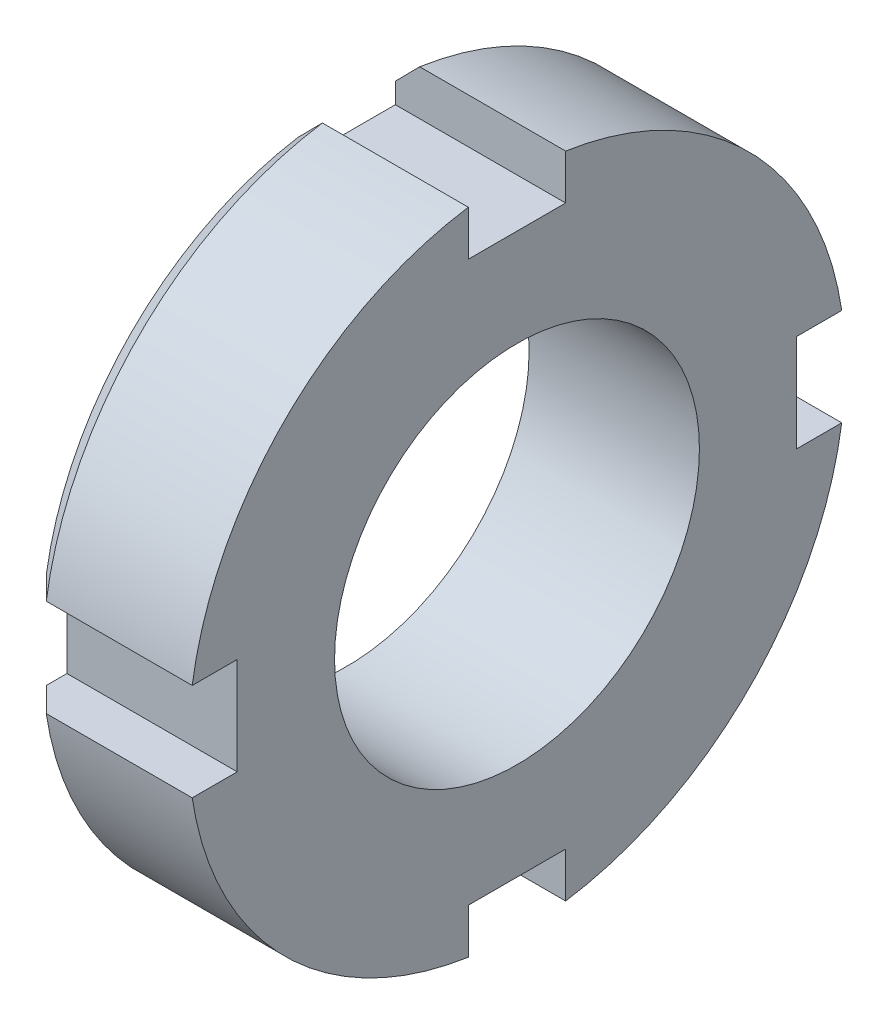
ISO-10303-21;
HEADER;
FILE_DESCRIPTION(('STEP AP214'),'2;1');
FILE_NAME('part.step','',(''),(''),'','','');
FILE_SCHEMA(('AUTOMOTIVE_DESIGN { 1 0 10303 214 1 1 1 1 }'));
ENDSEC;
DATA;
#1=APPLICATION_CONTEXT('core data for automotive mechanical design processes');
#2=APPLICATION_PROTOCOL_DEFINITION('international standard','automotive_design',2000,#1);
#3=PRODUCT_CONTEXT('',#1,'mechanical');
#4=PRODUCT('Part','Part','',(#3));
#5=PRODUCT_RELATED_PRODUCT_CATEGORY('part','',(#4));
#6=PRODUCT_DEFINITION_FORMATION('','',#4);
#7=PRODUCT_DEFINITION_CONTEXT('part definition',#1,'design');
#8=PRODUCT_DEFINITION('design','',#6,#7);
#9=PRODUCT_DEFINITION_SHAPE('','',#8);
#10=(LENGTH_UNIT() NAMED_UNIT(*) SI_UNIT(.MILLI.,.METRE.));
#11=(NAMED_UNIT(*) PLANE_ANGLE_UNIT() SI_UNIT($,.RADIAN.));
#12=(NAMED_UNIT(*) SI_UNIT($,.STERADIAN.) SOLID_ANGLE_UNIT());
#13=UNCERTAINTY_MEASURE_WITH_UNIT(LENGTH_MEASURE(1.E-05),#10,'distance_accuracy_value','');
#14=(GEOMETRIC_REPRESENTATION_CONTEXT(3) GLOBAL_UNCERTAINTY_ASSIGNED_CONTEXT((#13)) GLOBAL_UNIT_ASSIGNED_CONTEXT((#10,
#11,#12)) REPRESENTATION_CONTEXT('',''));
#15=CARTESIAN_POINT('',(0.,0.,0.));
#16=DIRECTION('',(0.,0.,1.));
#17=DIRECTION('',(1.,0.,0.));
#18=AXIS2_PLACEMENT_3D('',#15,#16,#17);
#19=CARTESIAN_POINT('',(7.,0.,0.));
#20=DIRECTION('',(-1.,0.,0.));
#21=DIRECTION('',(0.,0.,1.));
#22=AXIS2_PLACEMENT_3D('',#19,#20,#21);
#23=CYLINDRICAL_SURFACE('',#22,13.5);
#24=CARTESIAN_POINT('',(0.999999999999994,0.,0.));
#25=DIRECTION('',(1.,0.,0.));
#26=DIRECTION('',(0.,0.,-1.));
#27=AXIS2_PLACEMENT_3D('',#24,#25,#26);
#28=CIRCLE('',#27,13.5);
#29=CARTESIAN_POINT('',(0.999999999999993,13.3510299228187,2.));
#30=VERTEX_POINT('',#29);
#31=CARTESIAN_POINT('',(0.999999999999994,1.99999999999995,13.3510299228187));
#32=VERTEX_POINT('',#31);
#33=EDGE_CURVE('E313',#30,#32,#28,.T.);
#34=ORIENTED_EDGE('',*,*,#33,.T.);
#35=DIRECTION('',(-1.,0.,0.));
#36=VECTOR('',#35,1.);
#37=CARTESIAN_POINT('',(7.,1.99999999999995,13.3510299228187));
#38=LINE('',#37,#36);
#39=CARTESIAN_POINT('',(7.,1.99999999999995,13.3510299228187));
#40=VERTEX_POINT('',#39);
#41=EDGE_CURVE('E270',#32,#40,#38,.F.);
#42=ORIENTED_EDGE('',*,*,#41,.T.);
#43=CARTESIAN_POINT('',(7.,0.,0.));
#44=DIRECTION('',(1.,0.,0.));
#45=DIRECTION('',(0.,0.,-1.));
#46=AXIS2_PLACEMENT_3D('',#43,#44,#45);
#47=CIRCLE('',#46,13.5);
#48=CARTESIAN_POINT('',(7.,13.3510299228187,2.));
#49=VERTEX_POINT('',#48);
#50=EDGE_CURVE('E308',#49,#40,#47,.T.);
#51=ORIENTED_EDGE('',*,*,#50,.F.);
#52=DIRECTION('',(-1.,0.,0.));
#53=VECTOR('',#52,1.);
#54=CARTESIAN_POINT('',(7.,13.3510299228187,2.));
#55=LINE('',#54,#53);
#56=EDGE_CURVE('E293',#49,#30,#55,.T.);
#57=ORIENTED_EDGE('',*,*,#56,.T.);
#58=EDGE_LOOP('',(#34,#42,#51,#57));
#59=FACE_BOUND('',#58,.T.);
#60=ADVANCED_FACE('F42',(#59),#23,.T.);
#61=CARTESIAN_POINT('',(7.,-2.00000000000005,13.3510299228187));
#62=VERTEX_POINT('',#61);
#63=CARTESIAN_POINT('',(7.,-13.3510299228187,2.));
#64=VERTEX_POINT('',#63);
#65=EDGE_CURVE('E312',#62,#64,#47,.T.);
#66=ORIENTED_EDGE('',*,*,#65,.F.);
#67=DIRECTION('',(-1.,0.,0.));
#68=VECTOR('',#67,1.);
#69=CARTESIAN_POINT('',(7.,-2.00000000000005,13.3510299228187));
#70=LINE('',#69,#68);
#71=CARTESIAN_POINT('',(0.999999999999994,-2.00000000000005,13.3510299228187));
#72=VERTEX_POINT('',#71);
#73=EDGE_CURVE('E267',#62,#72,#70,.T.);
#74=ORIENTED_EDGE('',*,*,#73,.T.);
#75=CARTESIAN_POINT('',(0.999999999999993,-13.3510299228187,2.));
#76=VERTEX_POINT('',#75);
#77=EDGE_CURVE('E317',#72,#76,#28,.T.);
#78=ORIENTED_EDGE('',*,*,#77,.T.);
#79=DIRECTION('',(-1.,0.,0.));
#80=VECTOR('',#79,1.);
#81=CARTESIAN_POINT('',(7.,-13.3510299228187,2.));
#82=LINE('',#81,#80);
#83=EDGE_CURVE('E264',#76,#64,#82,.F.);
#84=ORIENTED_EDGE('',*,*,#83,.T.);
#85=EDGE_LOOP('',(#66,#74,#78,#84));
#86=FACE_BOUND('',#85,.T.);
#87=ADVANCED_FACE('F369',(#86),#23,.T.);
#88=CARTESIAN_POINT('',(7.,-13.3510299228187,-2.));
#89=VERTEX_POINT('',#88);
#90=CARTESIAN_POINT('',(7.,-1.99999999999986,-13.3510299228187));
#91=VERTEX_POINT('',#90);
#92=EDGE_CURVE('E382',#89,#91,#47,.T.);
#93=ORIENTED_EDGE('',*,*,#92,.F.);
#94=DIRECTION('',(-1.,0.,0.));
#95=VECTOR('',#94,1.);
#96=CARTESIAN_POINT('',(7.,-13.3510299228187,-2.));
#97=LINE('',#96,#95);
#98=CARTESIAN_POINT('',(0.999999999999993,-13.3510299228187,-2.));
#99=VERTEX_POINT('',#98);
#100=EDGE_CURVE('E261',#89,#99,#97,.T.);
#101=ORIENTED_EDGE('',*,*,#100,.T.);
#102=CARTESIAN_POINT('',(0.999999999999994,-1.99999999999986,-13.3510299228187));
#103=VERTEX_POINT('',#102);
#104=EDGE_CURVE('E400',#99,#103,#28,.T.);
#105=ORIENTED_EDGE('',*,*,#104,.T.);
#106=DIRECTION('',(-1.,0.,0.));
#107=VECTOR('',#106,1.);
#108=CARTESIAN_POINT('',(7.,-1.99999999999986,-13.3510299228187));
#109=LINE('',#108,#107);
#110=EDGE_CURVE('E258',#103,#91,#109,.F.);
#111=ORIENTED_EDGE('',*,*,#110,.T.);
#112=EDGE_LOOP('',(#93,#101,#105,#111));
#113=FACE_BOUND('',#112,.T.);
#114=ADVANCED_FACE('F361',(#113),#23,.T.);
#115=CARTESIAN_POINT('',(0.999999999999994,0.,0.));
#116=DIRECTION('',(1.,0.,0.));
#117=DIRECTION('',(0.,0.,-1.));
#118=AXIS2_PLACEMENT_3D('',#115,#116,#117);
#119=CONICAL_SURFACE('',#118,13.5,0.785398163397451);
#120=CARTESIAN_POINT('',(3.23626797749977,1.99999999999995,15.6086556070562));
#121=CARTESIAN_POINT('',(2.77921192274365,1.99999999999995,15.1478493826552));
#122=CARTESIAN_POINT('',(2.322307151743,1.99999999999995,14.6868929240559));
#123=CARTESIAN_POINT('',(1.40893717316766,1.99999999999995,13.76454641498));
#124=CARTESIAN_POINT('',(0.952471964799963,1.99999999999995,13.3031563652886));
#125=CARTESIAN_POINT('',(0.0401159814868857,1.99999999999996,12.3798074073296));
#126=CARTESIAN_POINT('',(-0.415774792862769,1.99999999999996,11.9178484984731));
#127=CARTESIAN_POINT('',(-1.32671721097167,1.99999999999996,10.9931025556262));
#128=CARTESIAN_POINT('',(-1.78176885318422,1.99999999999996,10.5303155201124));
#129=CARTESIAN_POINT('',(-2.23626797749978,1.99999999999997,10.0669853992989));
#130=B_SPLINE_CURVE_WITH_KNOTS('',3,(#120,#121,#122,#123,#124,#125,#126,#127,#128,#129),
.UNSPECIFIED.,.F.,.F.,(4,2,2,2,4),(0.,1.9470963103529,3.89418910137791,5.84128391001457,
7.78838230394807),.UNSPECIFIED.);
#131=CARTESIAN_POINT('',(0.,1.99999999999996,12.3389626792531));
#132=VERTEX_POINT('',#131);
#133=EDGE_CURVE('E11',#32,#132,#130,.T.);
#134=ORIENTED_EDGE('',*,*,#133,.F.);
#135=ORIENTED_EDGE('',*,*,#33,.F.);
#136=CARTESIAN_POINT('',(-2.23626797749979,10.0669853992988,2.));
#137=CARTESIAN_POINT('',(-1.78176885318423,10.5303155201124,2.));
#138=CARTESIAN_POINT('',(-1.32671721097167,10.9931025556262,2.));
#139=CARTESIAN_POINT('',(-0.415774792862772,11.9178484984731,2.));
#140=CARTESIAN_POINT('',(0.0401159814868844,12.3798074073296,2.));
#141=CARTESIAN_POINT('',(0.952471964799964,13.3031563652886,2.));
#142=CARTESIAN_POINT('',(1.40893717316766,13.76454641498,2.));
#143=CARTESIAN_POINT('',(2.322307151743,14.6868929240559,2.));
#144=CARTESIAN_POINT('',(2.77921192274365,15.1478493826552,2.));
#145=CARTESIAN_POINT('',(3.23626797749978,15.6086556070562,2.));
#146=B_SPLINE_CURVE_WITH_KNOTS('',3,(#136,#137,#138,#139,#140,#141,#142,#143,#144,#145),
.UNSPECIFIED.,.F.,.F.,(4,2,2,2,4),(0.,1.9470983939335,3.89419320257016,5.84128599359518,
7.78838230394808),.UNSPECIFIED.);
#147=CARTESIAN_POINT('',(0.,12.3389626792531,2.));
#148=VERTEX_POINT('',#147);
#149=EDGE_CURVE('E321',#148,#30,#146,.T.);
#150=ORIENTED_EDGE('',*,*,#149,.F.);
#151=CARTESIAN_POINT('',(0.,0.,0.));
#152=DIRECTION('',(1.,0.,0.));
#153=DIRECTION('',(0.,0.,-1.));
#154=AXIS2_PLACEMENT_3D('',#151,#152,#153);
#155=CIRCLE('',#154,12.5);
#156=EDGE_CURVE('E316',#132,#148,#155,.F.);
#157=ORIENTED_EDGE('',*,*,#156,.F.);
#158=EDGE_LOOP('',(#134,#135,#150,#157));
#159=FACE_BOUND('',#158,.T.);
#160=ADVANCED_FACE('F372',(#159),#119,.T.);
#161=CARTESIAN_POINT('',(-2.23626797749979,-2.00000000000003,10.0669853992988));
#162=CARTESIAN_POINT('',(-1.78176885318424,-2.00000000000004,10.5303155201124));
#163=CARTESIAN_POINT('',(-1.32671721097168,-2.00000000000004,10.9931025556261));
#164=CARTESIAN_POINT('',(-0.415774792862774,-2.00000000000004,11.9178484984731));
#165=CARTESIAN_POINT('',(0.0401159814868831,-2.00000000000004,12.3798074073296));
#166=CARTESIAN_POINT('',(0.952471964799965,-2.00000000000005,13.3031563652886));
#167=CARTESIAN_POINT('',(1.40893717316766,-2.00000000000005,13.76454641498));
#168=CARTESIAN_POINT('',(2.322307151743,-2.00000000000005,14.6868929240559));
#169=CARTESIAN_POINT('',(2.77921192274366,-2.00000000000005,15.1478493826552));
#170=CARTESIAN_POINT('',(3.23626797749979,-2.00000000000005,15.6086556070562));
#171=B_SPLINE_CURVE_WITH_KNOTS('',3,(#161,#162,#163,#164,#165,#166,#167,#168,#169,#170),
.UNSPECIFIED.,.F.,.F.,(4,2,2,2,4),(0.,1.9470983939335,3.89419320257017,5.84128599359519,
7.7883823039481),.UNSPECIFIED.);
#172=CARTESIAN_POINT('',(0.,-2.00000000000004,12.3389626792531));
#173=VERTEX_POINT('',#172);
#174=EDGE_CURVE('E57',#173,#72,#171,.T.);
#175=ORIENTED_EDGE('',*,*,#174,.F.);
#176=CARTESIAN_POINT('',(0.,-12.3389626792531,2.));
#177=VERTEX_POINT('',#176);
#178=EDGE_CURVE('E205',#177,#173,#155,.F.);
#179=ORIENTED_EDGE('',*,*,#178,.F.);
#180=CARTESIAN_POINT('',(3.23626797749978,-15.6086556070562,2.));
#181=CARTESIAN_POINT('',(2.77921192274365,-15.1478493826552,2.));
#182=CARTESIAN_POINT('',(2.322307151743,-14.6868929240559,2.));
#183=CARTESIAN_POINT('',(1.40893717316766,-13.76454641498,2.));
#184=CARTESIAN_POINT('',(0.952471964799964,-13.3031563652886,2.));
#185=CARTESIAN_POINT('',(0.0401159814868833,-12.3798074073296,2.));
#186=CARTESIAN_POINT('',(-0.415774792862774,-11.9178484984731,2.));
#187=CARTESIAN_POINT('',(-1.32671721097167,-10.9931025556262,2.));
#188=CARTESIAN_POINT('',(-1.78176885318423,-10.5303155201124,2.));
#189=CARTESIAN_POINT('',(-2.23626797749979,-10.0669853992988,2.));
#190=B_SPLINE_CURVE_WITH_KNOTS('',3,(#180,#181,#182,#183,#184,#185,#186,#187,#188,#189),
.UNSPECIFIED.,.F.,.F.,(4,2,2,2,4),(0.,1.94709631035291,3.89418910137792,5.84128391001459,
7.78838230394808),.UNSPECIFIED.);
#191=EDGE_CURVE('E406',#76,#177,#190,.T.);
#192=ORIENTED_EDGE('',*,*,#191,.F.);
#193=ORIENTED_EDGE('',*,*,#77,.F.);
#194=EDGE_LOOP('',(#175,#179,#192,#193));
#195=FACE_BOUND('',#194,.T.);
#196=ADVANCED_FACE('F365',(#195),#119,.T.);
#197=CARTESIAN_POINT('',(-2.23626797749979,-10.0669853992988,-2.));
#198=CARTESIAN_POINT('',(-1.78176885318423,-10.5303155201124,-2.));
#199=CARTESIAN_POINT('',(-1.32671721097167,-10.9931025556262,-2.));
#200=CARTESIAN_POINT('',(-0.415774792862772,-11.9178484984731,-2.));
#201=CARTESIAN_POINT('',(0.0401159814868844,-12.3798074073296,-2.));
#202=CARTESIAN_POINT('',(0.952471964799964,-13.3031563652886,-2.));
#203=CARTESIAN_POINT('',(1.40893717316766,-13.76454641498,-2.));
#204=CARTESIAN_POINT('',(2.322307151743,-14.6868929240559,-2.));
#205=CARTESIAN_POINT('',(2.77921192274365,-15.1478493826552,-2.));
#206=CARTESIAN_POINT('',(3.23626797749978,-15.6086556070562,-2.));
#207=B_SPLINE_CURVE_WITH_KNOTS('',3,(#197,#198,#199,#200,#201,#202,#203,#204,#205,#206),
.UNSPECIFIED.,.F.,.F.,(4,2,2,2,4),(0.,1.9470983939335,3.89419320257016,5.84128599359518,
7.78838230394808),.UNSPECIFIED.);
#208=CARTESIAN_POINT('',(0.,-12.3389626792531,-2.));
#209=VERTEX_POINT('',#208);
#210=EDGE_CURVE('E409',#209,#99,#207,.T.);
#211=ORIENTED_EDGE('',*,*,#210,.F.);
#212=CARTESIAN_POINT('',(0.,-1.99999999999987,-12.3389626792531));
#213=VERTEX_POINT('',#212);
#214=EDGE_CURVE('E322',#213,#209,#155,.F.);
#215=ORIENTED_EDGE('',*,*,#214,.F.);
#216=CARTESIAN_POINT('',(3.23626797749976,-1.99999999999984,-15.6086556070562));
#217=CARTESIAN_POINT('',(2.77921192274364,-1.99999999999984,-15.1478493826552));
#218=CARTESIAN_POINT('',(2.32230715174299,-1.99999999999985,-14.6868929240559));
#219=CARTESIAN_POINT('',(1.40893717316765,-1.99999999999986,-13.76454641498));
#220=CARTESIAN_POINT('',(0.95247196479996,-1.99999999999986,-13.3031563652886));
#221=CARTESIAN_POINT('',(0.0401159814868867,-1.99999999999987,-12.3798074073296));
#222=CARTESIAN_POINT('',(-0.415774792862766,-1.99999999999988,-11.9178484984731));
#223=CARTESIAN_POINT('',(-1.32671721097166,-1.99999999999989,-10.9931025556262));
#224=CARTESIAN_POINT('',(-1.78176885318422,-1.99999999999989,-10.5303155201124));
#225=CARTESIAN_POINT('',(-2.23626797749977,-1.9999999999999,-10.0669853992989));
#226=B_SPLINE_CURVE_WITH_KNOTS('',3,(#216,#217,#218,#219,#220,#221,#222,#223,#224,#225),
.UNSPECIFIED.,.F.,.F.,(4,2,2,2,4),(0.,1.9470963103529,3.8941891013779,5.84128391001455,
7.78838230394803),.UNSPECIFIED.);
#227=EDGE_CURVE('E411',#103,#213,#226,.T.);
#228=ORIENTED_EDGE('',*,*,#227,.F.);
#229=ORIENTED_EDGE('',*,*,#104,.F.);
#230=EDGE_LOOP('',(#211,#215,#228,#229));
#231=FACE_BOUND('',#230,.T.);
#232=ADVANCED_FACE('F359',(#231),#119,.T.);
#233=CARTESIAN_POINT('',(7.,2.00000000000014,-13.3510299228187));
#234=VERTEX_POINT('',#233);
#235=CARTESIAN_POINT('',(7.,13.3510299228187,-2.));
#236=VERTEX_POINT('',#235);
#237=EDGE_CURVE('E305',#234,#236,#47,.T.);
#238=ORIENTED_EDGE('',*,*,#237,.F.);
#239=DIRECTION('',(-1.,0.,0.));
#240=VECTOR('',#239,1.);
#241=CARTESIAN_POINT('',(7.,2.00000000000014,-13.3510299228187));
#242=LINE('',#241,#240);
#243=CARTESIAN_POINT('',(0.999999999999994,2.00000000000014,-13.3510299228187));
#244=VERTEX_POINT('',#243);
#245=EDGE_CURVE('E216',#234,#244,#242,.T.);
#246=ORIENTED_EDGE('',*,*,#245,.T.);
#247=CARTESIAN_POINT('',(0.999999999999993,13.3510299228187,-2.));
#248=VERTEX_POINT('',#247);
#249=EDGE_CURVE('E311',#244,#248,#28,.T.);
#250=ORIENTED_EDGE('',*,*,#249,.T.);
#251=DIRECTION('',(-1.,0.,0.));
#252=VECTOR('',#251,1.);
#253=CARTESIAN_POINT('',(7.,13.3510299228187,-2.));
#254=LINE('',#253,#252);
#255=EDGE_CURVE('E298',#248,#236,#254,.F.);
#256=ORIENTED_EDGE('',*,*,#255,.T.);
#257=EDGE_LOOP('',(#238,#246,#250,#256));
#258=FACE_BOUND('',#257,.T.);
#259=ADVANCED_FACE('F355',(#258),#23,.T.);
#260=CARTESIAN_POINT('',(7.,0.,0.));
#261=DIRECTION('',(1.,0.,0.));
#262=DIRECTION('',(0.,0.,-1.));
#263=AXIS2_PLACEMENT_3D('',#260,#261,#262);
#264=PLANE('',#263);
#265=DIRECTION('',(0.,0.,1.));
#266=VECTOR('',#265,1.);
#267=CARTESIAN_POINT('',(7.,1.99999999999995,15.5));
#268=LINE('',#267,#266);
#269=CARTESIAN_POINT('',(7.,1.99999999999996,11.5));
#270=VERTEX_POINT('',#269);
#271=EDGE_CURVE('E211',#270,#40,#268,.T.);
#272=ORIENTED_EDGE('',*,*,#271,.F.);
#273=DIRECTION('',(0.,1.,0.));
#274=VECTOR('',#273,1.);
#275=CARTESIAN_POINT('',(7.,-2.00000000000004,11.5));
#276=LINE('',#275,#274);
#277=CARTESIAN_POINT('',(7.,-2.00000000000004,11.5));
#278=VERTEX_POINT('',#277);
#279=EDGE_CURVE('E208',#278,#270,#276,.T.);
#280=ORIENTED_EDGE('',*,*,#279,.F.);
#281=DIRECTION('',(0.,0.,-1.));
#282=VECTOR('',#281,1.);
#283=CARTESIAN_POINT('',(7.,-2.00000000000005,15.5));
#284=LINE('',#283,#282);
#285=EDGE_CURVE('E187',#62,#278,#284,.T.);
#286=ORIENTED_EDGE('',*,*,#285,.F.);
#287=ORIENTED_EDGE('',*,*,#65,.T.);
#288=DIRECTION('',(0.,-1.,0.));
#289=VECTOR('',#288,1.);
#290=CARTESIAN_POINT('',(7.,-15.5,2.));
#291=LINE('',#290,#289);
#292=CARTESIAN_POINT('',(7.,-11.5,2.));
#293=VERTEX_POINT('',#292);
#294=EDGE_CURVE('E226',#293,#64,#291,.T.);
#295=ORIENTED_EDGE('',*,*,#294,.F.);
#296=DIRECTION('',(0.,0.,1.));
#297=VECTOR('',#296,1.);
#298=CARTESIAN_POINT('',(7.,-11.5,-2.));
#299=LINE('',#298,#297);
#300=CARTESIAN_POINT('',(7.,-11.5,-2.));
#301=VERTEX_POINT('',#300);
#302=EDGE_CURVE('E220',#301,#293,#299,.T.);
#303=ORIENTED_EDGE('',*,*,#302,.F.);
#304=DIRECTION('',(0.,1.,0.));
#305=VECTOR('',#304,1.);
#306=CARTESIAN_POINT('',(7.,-15.5,-2.));
#307=LINE('',#306,#305);
#308=EDGE_CURVE('E228',#89,#301,#307,.T.);
#309=ORIENTED_EDGE('',*,*,#308,.F.);
#310=ORIENTED_EDGE('',*,*,#92,.T.);
#311=DIRECTION('',(0.,0.,-1.));
#312=VECTOR('',#311,1.);
#313=CARTESIAN_POINT('',(7.,-1.99999999999984,-15.5));
#314=LINE('',#313,#312);
#315=CARTESIAN_POINT('',(7.,-1.99999999999988,-11.5));
#316=VERTEX_POINT('',#315);
#317=EDGE_CURVE('E247',#316,#91,#314,.T.);
#318=ORIENTED_EDGE('',*,*,#317,.F.);
#319=DIRECTION('',(0.,-1.,0.));
#320=VECTOR('',#319,1.);
#321=CARTESIAN_POINT('',(7.,2.00000000000012,-11.5));
#322=LINE('',#321,#320);
#323=CARTESIAN_POINT('',(7.,2.00000000000012,-11.5));
#324=VERTEX_POINT('',#323);
#325=EDGE_CURVE('E240',#324,#316,#322,.T.);
#326=ORIENTED_EDGE('',*,*,#325,.F.);
#327=DIRECTION('',(0.,0.,1.));
#328=VECTOR('',#327,1.);
#329=CARTESIAN_POINT('',(7.,2.00000000000016,-15.5));
#330=LINE('',#329,#328);
#331=EDGE_CURVE('E249',#234,#324,#330,.T.);
#332=ORIENTED_EDGE('',*,*,#331,.F.);
#333=ORIENTED_EDGE('',*,*,#237,.T.);
#334=DIRECTION('',(0.,1.,0.));
#335=VECTOR('',#334,1.);
#336=CARTESIAN_POINT('',(7.,15.5,-2.));
#337=LINE('',#336,#335);
#338=CARTESIAN_POINT('',(7.,11.5,-2.));
#339=VERTEX_POINT('',#338);
#340=EDGE_CURVE('E273',#339,#236,#337,.T.);
#341=ORIENTED_EDGE('',*,*,#340,.F.);
#342=DIRECTION('',(0.,0.,-1.));
#343=VECTOR('',#342,1.);
#344=CARTESIAN_POINT('',(7.,11.5,2.));
#345=LINE('',#344,#343);
#346=CARTESIAN_POINT('',(7.,11.5,2.));
#347=VERTEX_POINT('',#346);
#348=EDGE_CURVE('E278',#347,#339,#345,.T.);
#349=ORIENTED_EDGE('',*,*,#348,.F.);
#350=DIRECTION('',(0.,-1.,0.));
#351=VECTOR('',#350,1.);
#352=CARTESIAN_POINT('',(7.,15.5,2.));
#353=LINE('',#352,#351);
#354=EDGE_CURVE('E287',#49,#347,#353,.T.);
#355=ORIENTED_EDGE('',*,*,#354,.F.);
#356=ORIENTED_EDGE('',*,*,#50,.T.);
#357=EDGE_LOOP('',(#272,#280,#286,#287,#295,#303,#309,#310,#318,#326,#332,#333,#341,#349,#355,#356));
#358=FACE_BOUND('',#357,.T.);
#359=CARTESIAN_POINT('',(7.,0.,0.));
#360=DIRECTION('',(1.,0.,0.));
#361=DIRECTION('',(0.,0.,-1.));
#362=AXIS2_PLACEMENT_3D('',#359,#360,#361);
#363=CIRCLE('',#362,7.5);
#364=CARTESIAN_POINT('',(7.,0.,-7.5));
#365=VERTEX_POINT('',#364);
#366=EDGE_CURVE('E301',#365,#365,#363,.T.);
#367=ORIENTED_EDGE('',*,*,#366,.F.);
#368=EDGE_LOOP('',(#367));
#369=FACE_BOUND('',#368,.T.);
#370=ADVANCED_FACE('F352',(#358,#369),#264,.T.);
#371=CARTESIAN_POINT('',(0.,0.,0.));
#372=DIRECTION('',(1.,0.,0.));
#373=DIRECTION('',(0.,0.,-1.));
#374=AXIS2_PLACEMENT_3D('',#371,#372,#373);
#375=PLANE('',#374);
#376=DIRECTION('',(0.,1.,0.));
#377=VECTOR('',#376,1.);
#378=CARTESIAN_POINT('',(0.,-2.00000000000004,11.5));
#379=LINE('',#378,#377);
#380=CARTESIAN_POINT('',(0.,-2.00000000000004,11.5));
#381=VERTEX_POINT('',#380);
#382=CARTESIAN_POINT('',(0.,1.99999999999996,11.5));
#383=VERTEX_POINT('',#382);
#384=EDGE_CURVE('E192',#381,#383,#379,.T.);
#385=ORIENTED_EDGE('',*,*,#384,.T.);
#386=DIRECTION('',(0.,0.,1.));
#387=VECTOR('',#386,1.);
#388=CARTESIAN_POINT('',(0.,1.99999999999995,15.5));
#389=LINE('',#388,#387);
#390=EDGE_CURVE('E206',#383,#132,#389,.T.);
#391=ORIENTED_EDGE('',*,*,#390,.T.);
#392=ORIENTED_EDGE('',*,*,#156,.T.);
#393=DIRECTION('',(0.,-1.,0.));
#394=VECTOR('',#393,1.);
#395=CARTESIAN_POINT('',(0.,15.5,2.));
#396=LINE('',#395,#394);
#397=CARTESIAN_POINT('',(0.,11.5,2.));
#398=VERTEX_POINT('',#397);
#399=EDGE_CURVE('E277',#148,#398,#396,.T.);
#400=ORIENTED_EDGE('',*,*,#399,.T.);
#401=DIRECTION('',(0.,0.,-1.));
#402=VECTOR('',#401,1.);
#403=CARTESIAN_POINT('',(0.,11.5,2.));
#404=LINE('',#403,#402);
#405=CARTESIAN_POINT('',(0.,11.5,-2.));
#406=VERTEX_POINT('',#405);
#407=EDGE_CURVE('E281',#398,#406,#404,.T.);
#408=ORIENTED_EDGE('',*,*,#407,.T.);
#409=DIRECTION('',(0.,1.,0.));
#410=VECTOR('',#409,1.);
#411=CARTESIAN_POINT('',(0.,15.5,-2.));
#412=LINE('',#411,#410);
#413=CARTESIAN_POINT('',(0.,12.3389626792531,-2.));
#414=VERTEX_POINT('',#413);
#415=EDGE_CURVE('E274',#406,#414,#412,.T.);
#416=ORIENTED_EDGE('',*,*,#415,.T.);
#417=CARTESIAN_POINT('',(0.,2.00000000000013,-12.338962679253));
#418=VERTEX_POINT('',#417);
#419=EDGE_CURVE('E318',#414,#418,#155,.F.);
#420=ORIENTED_EDGE('',*,*,#419,.T.);
#421=DIRECTION('',(0.,0.,1.));
#422=VECTOR('',#421,1.);
#423=CARTESIAN_POINT('',(0.,2.00000000000016,-15.5));
#424=LINE('',#423,#422);
#425=CARTESIAN_POINT('',(0.,2.00000000000012,-11.5));
#426=VERTEX_POINT('',#425);
#427=EDGE_CURVE('E239',#418,#426,#424,.T.);
#428=ORIENTED_EDGE('',*,*,#427,.T.);
#429=DIRECTION('',(0.,-1.,0.));
#430=VECTOR('',#429,1.);
#431=CARTESIAN_POINT('',(0.,2.00000000000012,-11.5));
#432=LINE('',#431,#430);
#433=CARTESIAN_POINT('',(0.,-1.99999999999988,-11.5));
#434=VERTEX_POINT('',#433);
#435=EDGE_CURVE('E243',#426,#434,#432,.T.);
#436=ORIENTED_EDGE('',*,*,#435,.T.);
#437=DIRECTION('',(0.,0.,-1.));
#438=VECTOR('',#437,1.);
#439=CARTESIAN_POINT('',(0.,-1.99999999999984,-15.5));
#440=LINE('',#439,#438);
#441=EDGE_CURVE('E236',#434,#213,#440,.T.);
#442=ORIENTED_EDGE('',*,*,#441,.T.);
#443=ORIENTED_EDGE('',*,*,#214,.T.);
#444=DIRECTION('',(0.,1.,0.));
#445=VECTOR('',#444,1.);
#446=CARTESIAN_POINT('',(0.,-15.5,-2.));
#447=LINE('',#446,#445);
#448=CARTESIAN_POINT('',(0.,-11.5,-2.));
#449=VERTEX_POINT('',#448);
#450=EDGE_CURVE('E72',#209,#449,#447,.T.);
#451=ORIENTED_EDGE('',*,*,#450,.T.);
#452=DIRECTION('',(0.,0.,1.));
#453=VECTOR('',#452,1.);
#454=CARTESIAN_POINT('',(0.,-11.5,-2.));
#455=LINE('',#454,#453);
#456=CARTESIAN_POINT('',(0.,-11.5,2.));
#457=VERTEX_POINT('',#456);
#458=EDGE_CURVE('E222',#449,#457,#455,.T.);
#459=ORIENTED_EDGE('',*,*,#458,.T.);
#460=DIRECTION('',(0.,-1.,0.));
#461=VECTOR('',#460,1.);
#462=CARTESIAN_POINT('',(0.,-15.5,2.));
#463=LINE('',#462,#461);
#464=EDGE_CURVE('E218',#457,#177,#463,.T.);
#465=ORIENTED_EDGE('',*,*,#464,.T.);
#466=ORIENTED_EDGE('',*,*,#178,.T.);
#467=DIRECTION('',(0.,0.,-1.));
#468=VECTOR('',#467,1.);
#469=CARTESIAN_POINT('',(0.,-2.00000000000005,15.5));
#470=LINE('',#469,#468);
#471=EDGE_CURVE('E64',#173,#381,#470,.T.);
#472=ORIENTED_EDGE('',*,*,#471,.T.);
#473=EDGE_LOOP('',(#385,#391,#392,#400,#408,#416,#420,#428,#436,#442,#443,#451,#459,#465,#466,#472));
#474=FACE_BOUND('',#473,.T.);
#475=CARTESIAN_POINT('',(0.,0.,0.));
#476=DIRECTION('',(1.,0.,0.));
#477=DIRECTION('',(0.,0.,-1.));
#478=AXIS2_PLACEMENT_3D('',#475,#476,#477);
#479=CIRCLE('',#478,7.5);
#480=CARTESIAN_POINT('',(0.,0.,-7.5));
#481=VERTEX_POINT('',#480);
#482=EDGE_CURVE('E302',#481,#481,#479,.T.);
#483=ORIENTED_EDGE('',*,*,#482,.T.);
#484=EDGE_LOOP('',(#483));
#485=FACE_BOUND('',#484,.T.);
#486=ADVANCED_FACE('F201',(#474,#485),#375,.F.);
#487=CARTESIAN_POINT('',(0.,0.,0.));
#488=DIRECTION('',(1.,0.,0.));
#489=DIRECTION('',(0.,0.,-1.));
#490=AXIS2_PLACEMENT_3D('',#487,#488,#489);
#491=CYLINDRICAL_SURFACE('',#490,7.5);
#492=ORIENTED_EDGE('',*,*,#482,.F.);
#493=EDGE_LOOP('',(#492));
#494=FACE_BOUND('',#493,.T.);
#495=ORIENTED_EDGE('',*,*,#366,.T.);
#496=EDGE_LOOP('',(#495));
#497=FACE_BOUND('',#496,.T.);
#498=ADVANCED_FACE('F348',(#494,#497),#491,.F.);
#499=CARTESIAN_POINT('',(-2.2362679774998,2.0000000000001,-10.0669853992988));
#500=CARTESIAN_POINT('',(-1.78176885318425,2.00000000000011,-10.5303155201124));
#501=CARTESIAN_POINT('',(-1.32671721097168,2.00000000000011,-10.9931025556261));
#502=CARTESIAN_POINT('',(-0.415774792862778,2.00000000000012,-11.9178484984731));
#503=CARTESIAN_POINT('',(0.040115981486881,2.00000000000013,-12.3798074073296));
#504=CARTESIAN_POINT('',(0.952471964799966,2.00000000000014,-13.3031563652885));
#505=CARTESIAN_POINT('',(1.40893717316766,2.00000000000014,-13.76454641498));
#506=CARTESIAN_POINT('',(2.32230715174301,2.00000000000015,-14.6868929240559));
#507=CARTESIAN_POINT('',(2.77921192274367,2.00000000000016,-15.1478493826552));
#508=CARTESIAN_POINT('',(3.2362679774998,2.00000000000016,-15.6086556070562));
#509=B_SPLINE_CURVE_WITH_KNOTS('',3,(#499,#500,#501,#502,#503,#504,#505,#506,#507,#508),
.UNSPECIFIED.,.F.,.F.,(4,2,2,2,4),(0.,1.94709839393351,3.89419320257019,5.84128599359521,
7.78838230394813),.UNSPECIFIED.);
#510=EDGE_CURVE('E446',#418,#244,#509,.T.);
#511=ORIENTED_EDGE('',*,*,#510,.F.);
#512=ORIENTED_EDGE('',*,*,#419,.F.);
#513=CARTESIAN_POINT('',(3.23626797749978,15.6086556070562,-2.));
#514=CARTESIAN_POINT('',(2.77921192274365,15.1478493826552,-2.));
#515=CARTESIAN_POINT('',(2.322307151743,14.6868929240559,-2.));
#516=CARTESIAN_POINT('',(1.40893717316766,13.76454641498,-2.));
#517=CARTESIAN_POINT('',(0.952471964799964,13.3031563652886,-2.));
#518=CARTESIAN_POINT('',(0.0401159814868833,12.3798074073296,-2.));
#519=CARTESIAN_POINT('',(-0.415774792862774,11.9178484984731,-2.));
#520=CARTESIAN_POINT('',(-1.32671721097167,10.9931025556262,-2.));
#521=CARTESIAN_POINT('',(-1.78176885318423,10.5303155201124,-2.));
#522=CARTESIAN_POINT('',(-2.23626797749979,10.0669853992988,-2.));
#523=B_SPLINE_CURVE_WITH_KNOTS('',3,(#513,#514,#515,#516,#517,#518,#519,#520,#521,#522),
.UNSPECIFIED.,.F.,.F.,(4,2,2,2,4),(0.,1.94709631035291,3.89418910137792,5.84128391001459,
7.78838230394808),.UNSPECIFIED.);
#524=EDGE_CURVE('E329',#248,#414,#523,.T.);
#525=ORIENTED_EDGE('',*,*,#524,.F.);
#526=ORIENTED_EDGE('',*,*,#249,.F.);
#527=EDGE_LOOP('',(#511,#512,#525,#526));
#528=FACE_BOUND('',#527,.T.);
#529=ADVANCED_FACE('F45',(#528),#119,.T.);
#530=CARTESIAN_POINT('',(0.,15.5,-2.));
#531=DIRECTION('',(0.,0.,-1.));
#532=DIRECTION('',(0.,1.,0.));
#533=AXIS2_PLACEMENT_3D('',#530,#531,#532);
#534=PLANE('',#533);
#535=ORIENTED_EDGE('',*,*,#524,.T.);
#536=ORIENTED_EDGE('',*,*,#415,.F.);
#537=DIRECTION('',(1.,0.,0.));
#538=VECTOR('',#537,1.);
#539=CARTESIAN_POINT('',(0.,11.5,-2.));
#540=LINE('',#539,#538);
#541=EDGE_CURVE('E291',#406,#339,#540,.T.);
#542=ORIENTED_EDGE('',*,*,#541,.T.);
#543=ORIENTED_EDGE('',*,*,#340,.T.);
#544=ORIENTED_EDGE('',*,*,#255,.F.);
#545=EDGE_LOOP('',(#535,#536,#542,#543,#544));
#546=FACE_BOUND('',#545,.T.);
#547=ADVANCED_FACE('F341',(#546),#534,.F.);
#548=CARTESIAN_POINT('',(0.,15.5,2.));
#549=DIRECTION('',(0.,0.,1.));
#550=DIRECTION('',(0.,-1.,0.));
#551=AXIS2_PLACEMENT_3D('',#548,#549,#550);
#552=PLANE('',#551);
#553=ORIENTED_EDGE('',*,*,#354,.T.);
#554=DIRECTION('',(1.,0.,0.));
#555=VECTOR('',#554,1.);
#556=CARTESIAN_POINT('',(0.,11.5,2.));
#557=LINE('',#556,#555);
#558=EDGE_CURVE('E284',#398,#347,#557,.T.);
#559=ORIENTED_EDGE('',*,*,#558,.F.);
#560=ORIENTED_EDGE('',*,*,#399,.F.);
#561=ORIENTED_EDGE('',*,*,#149,.T.);
#562=ORIENTED_EDGE('',*,*,#56,.F.);
#563=EDGE_LOOP('',(#553,#559,#560,#561,#562));
#564=FACE_BOUND('',#563,.T.);
#565=ADVANCED_FACE('F336',(#564),#552,.F.);
#566=CARTESIAN_POINT('',(0.,11.5,2.));
#567=DIRECTION('',(0.,-1.,0.));
#568=DIRECTION('',(0.,0.,-1.));
#569=AXIS2_PLACEMENT_3D('',#566,#567,#568);
#570=PLANE('',#569);
#571=ORIENTED_EDGE('',*,*,#348,.T.);
#572=ORIENTED_EDGE('',*,*,#541,.F.);
#573=ORIENTED_EDGE('',*,*,#407,.F.);
#574=ORIENTED_EDGE('',*,*,#558,.T.);
#575=EDGE_LOOP('',(#571,#572,#573,#574));
#576=FACE_BOUND('',#575,.T.);
#577=ADVANCED_FACE('F340',(#576),#570,.F.);
#578=CARTESIAN_POINT('',(0.,-1.99999999999984,-15.5));
#579=DIRECTION('',(0.,-1.,0.));
#580=DIRECTION('',(0.,0.,-1.));
#581=AXIS2_PLACEMENT_3D('',#578,#579,#580);
#582=PLANE('',#581);
#583=ORIENTED_EDGE('',*,*,#227,.T.);
#584=ORIENTED_EDGE('',*,*,#441,.F.);
#585=DIRECTION('',(1.,0.,0.));
#586=VECTOR('',#585,1.);
#587=CARTESIAN_POINT('',(0.,-1.99999999999988,-11.5));
#588=LINE('',#587,#586);
#589=EDGE_CURVE('E229',#434,#316,#588,.T.);
#590=ORIENTED_EDGE('',*,*,#589,.T.);
#591=ORIENTED_EDGE('',*,*,#317,.T.);
#592=ORIENTED_EDGE('',*,*,#110,.F.);
#593=EDGE_LOOP('',(#583,#584,#590,#591,#592));
#594=FACE_BOUND('',#593,.T.);
#595=ADVANCED_FACE('F443',(#594),#582,.F.);
#596=CARTESIAN_POINT('',(0.,2.00000000000016,-15.5));
#597=DIRECTION('',(0.,1.,0.));
#598=DIRECTION('',(0.,0.,1.));
#599=AXIS2_PLACEMENT_3D('',#596,#597,#598);
#600=PLANE('',#599);
#601=ORIENTED_EDGE('',*,*,#331,.T.);
#602=DIRECTION('',(1.,0.,0.));
#603=VECTOR('',#602,1.);
#604=CARTESIAN_POINT('',(0.,2.00000000000012,-11.5));
#605=LINE('',#604,#603);
#606=EDGE_CURVE('E246',#426,#324,#605,.T.);
#607=ORIENTED_EDGE('',*,*,#606,.F.);
#608=ORIENTED_EDGE('',*,*,#427,.F.);
#609=ORIENTED_EDGE('',*,*,#510,.T.);
#610=ORIENTED_EDGE('',*,*,#245,.F.);
#611=EDGE_LOOP('',(#601,#607,#608,#609,#610));
#612=FACE_BOUND('',#611,.T.);
#613=ADVANCED_FACE('F439',(#612),#600,.F.);
#614=CARTESIAN_POINT('',(0.,2.00000000000012,-11.5));
#615=DIRECTION('',(0.,0.,1.));
#616=DIRECTION('',(0.,-1.,0.));
#617=AXIS2_PLACEMENT_3D('',#614,#615,#616);
#618=PLANE('',#617);
#619=ORIENTED_EDGE('',*,*,#325,.T.);
#620=ORIENTED_EDGE('',*,*,#589,.F.);
#621=ORIENTED_EDGE('',*,*,#435,.F.);
#622=ORIENTED_EDGE('',*,*,#606,.T.);
#623=EDGE_LOOP('',(#619,#620,#621,#622));
#624=FACE_BOUND('',#623,.T.);
#625=ADVANCED_FACE('F434',(#624),#618,.F.);
#626=CARTESIAN_POINT('',(0.,-15.5,2.));
#627=DIRECTION('',(0.,0.,1.));
#628=DIRECTION('',(0.,-1.,0.));
#629=AXIS2_PLACEMENT_3D('',#626,#627,#628);
#630=PLANE('',#629);
#631=ORIENTED_EDGE('',*,*,#191,.T.);
#632=ORIENTED_EDGE('',*,*,#464,.F.);
#633=DIRECTION('',(1.,0.,0.));
#634=VECTOR('',#633,1.);
#635=CARTESIAN_POINT('',(0.,-11.5,2.));
#636=LINE('',#635,#634);
#637=EDGE_CURVE('E213',#457,#293,#636,.T.);
#638=ORIENTED_EDGE('',*,*,#637,.T.);
#639=ORIENTED_EDGE('',*,*,#294,.T.);
#640=ORIENTED_EDGE('',*,*,#83,.F.);
#641=EDGE_LOOP('',(#631,#632,#638,#639,#640));
#642=FACE_BOUND('',#641,.T.);
#643=ADVANCED_FACE('F429',(#642),#630,.F.);
#644=CARTESIAN_POINT('',(0.,-15.5,-2.));
#645=DIRECTION('',(0.,0.,-1.));
#646=DIRECTION('',(0.,1.,0.));
#647=AXIS2_PLACEMENT_3D('',#644,#645,#646);
#648=PLANE('',#647);
#649=ORIENTED_EDGE('',*,*,#308,.T.);
#650=DIRECTION('',(1.,0.,0.));
#651=VECTOR('',#650,1.);
#652=CARTESIAN_POINT('',(0.,-11.5,-2.));
#653=LINE('',#652,#651);
#654=EDGE_CURVE('E225',#449,#301,#653,.T.);
#655=ORIENTED_EDGE('',*,*,#654,.F.);
#656=ORIENTED_EDGE('',*,*,#450,.F.);
#657=ORIENTED_EDGE('',*,*,#210,.T.);
#658=ORIENTED_EDGE('',*,*,#100,.F.);
#659=EDGE_LOOP('',(#649,#655,#656,#657,#658));
#660=FACE_BOUND('',#659,.T.);
#661=ADVANCED_FACE('F433',(#660),#648,.F.);
#662=CARTESIAN_POINT('',(0.,-11.5,-2.));
#663=DIRECTION('',(0.,1.,0.));
#664=DIRECTION('',(0.,0.,1.));
#665=AXIS2_PLACEMENT_3D('',#662,#663,#664);
#666=PLANE('',#665);
#667=ORIENTED_EDGE('',*,*,#302,.T.);
#668=ORIENTED_EDGE('',*,*,#637,.F.);
#669=ORIENTED_EDGE('',*,*,#458,.F.);
#670=ORIENTED_EDGE('',*,*,#654,.T.);
#671=EDGE_LOOP('',(#667,#668,#669,#670));
#672=FACE_BOUND('',#671,.T.);
#673=ADVANCED_FACE('F514',(#672),#666,.F.);
#674=CARTESIAN_POINT('',(0.,1.99999999999995,15.5));
#675=DIRECTION('',(0.,1.,0.));
#676=DIRECTION('',(0.,0.,1.));
#677=AXIS2_PLACEMENT_3D('',#674,#675,#676);
#678=PLANE('',#677);
#679=ORIENTED_EDGE('',*,*,#133,.T.);
#680=ORIENTED_EDGE('',*,*,#390,.F.);
#681=DIRECTION('',(1.,0.,0.));
#682=VECTOR('',#681,1.);
#683=CARTESIAN_POINT('',(0.,1.99999999999996,11.5));
#684=LINE('',#683,#682);
#685=EDGE_CURVE('E191',#383,#270,#684,.T.);
#686=ORIENTED_EDGE('',*,*,#685,.T.);
#687=ORIENTED_EDGE('',*,*,#271,.T.);
#688=ORIENTED_EDGE('',*,*,#41,.F.);
#689=EDGE_LOOP('',(#679,#680,#686,#687,#688));
#690=FACE_BOUND('',#689,.T.);
#691=ADVANCED_FACE('F520',(#690),#678,.F.);
#692=CARTESIAN_POINT('',(0.,-2.00000000000005,15.5));
#693=DIRECTION('',(0.,-1.,0.));
#694=DIRECTION('',(0.,0.,-1.));
#695=AXIS2_PLACEMENT_3D('',#692,#693,#694);
#696=PLANE('',#695);
#697=ORIENTED_EDGE('',*,*,#285,.T.);
#698=DIRECTION('',(1.,0.,0.));
#699=VECTOR('',#698,1.);
#700=CARTESIAN_POINT('',(0.,-2.00000000000004,11.5));
#701=LINE('',#700,#699);
#702=EDGE_CURVE('E183',#381,#278,#701,.T.);
#703=ORIENTED_EDGE('',*,*,#702,.F.);
#704=ORIENTED_EDGE('',*,*,#471,.F.);
#705=ORIENTED_EDGE('',*,*,#174,.T.);
#706=ORIENTED_EDGE('',*,*,#73,.F.);
#707=EDGE_LOOP('',(#697,#703,#704,#705,#706));
#708=FACE_BOUND('',#707,.T.);
#709=ADVANCED_FACE('F185',(#708),#696,.F.);
#710=CARTESIAN_POINT('',(0.,-2.00000000000004,11.5));
#711=DIRECTION('',(0.,0.,-1.));
#712=DIRECTION('',(0.,1.,0.));
#713=AXIS2_PLACEMENT_3D('',#710,#711,#712);
#714=PLANE('',#713);
#715=ORIENTED_EDGE('',*,*,#279,.T.);
#716=ORIENTED_EDGE('',*,*,#685,.F.);
#717=ORIENTED_EDGE('',*,*,#384,.F.);
#718=ORIENTED_EDGE('',*,*,#702,.T.);
#719=EDGE_LOOP('',(#715,#716,#717,#718));
#720=FACE_BOUND('',#719,.T.);
#721=ADVANCED_FACE('F195',(#720),#714,.F.);
#722=CLOSED_SHELL('',(#60,#87,#114,#160,#196,#232,#259,#370,#486,#498,#529,#547,#565,#577,#595,
#613,#625,#643,#661,#673,#691,#709,#721));
#723=MANIFOLD_SOLID_BREP('B2',#722);
#724=ADVANCED_BREP_SHAPE_REPRESENTATION('',(#18,#723),#14);
#725=SHAPE_DEFINITION_REPRESENTATION(#9,#724);
ENDSEC;
END-ISO-10303-21;
